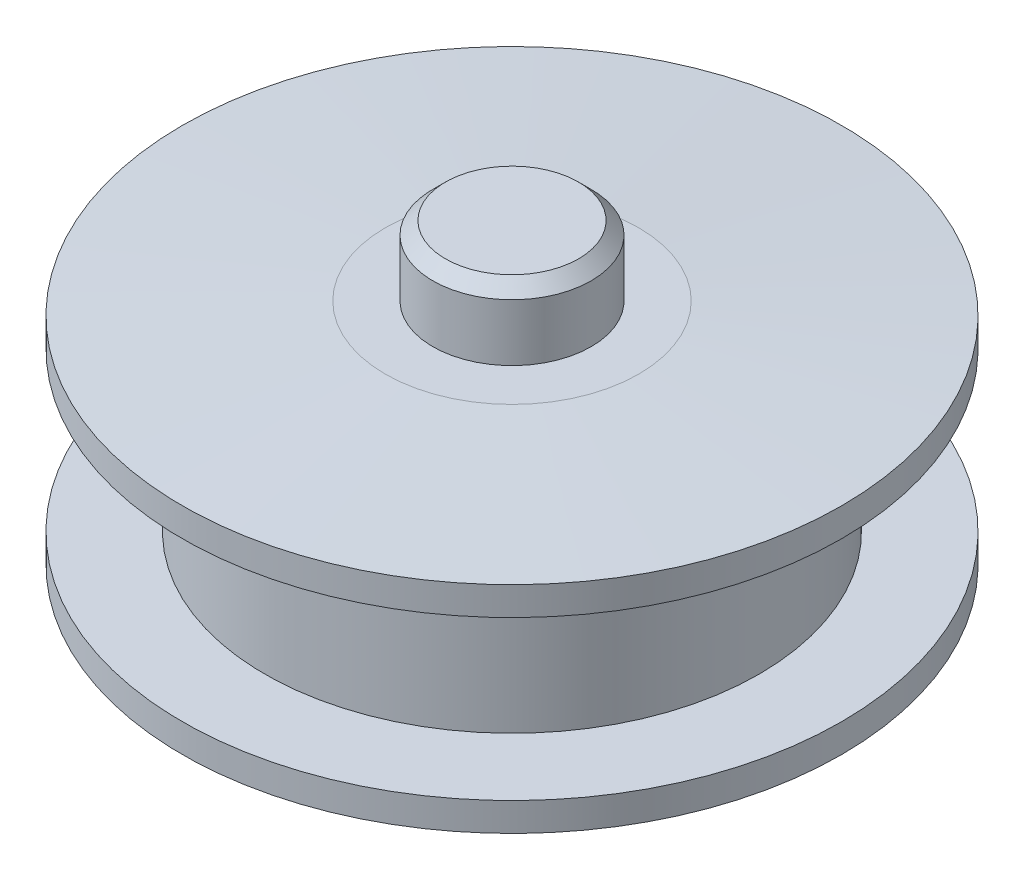
ISO-10303-21;
HEADER;
FILE_DESCRIPTION(('STEP AP214'),'2;1');
FILE_NAME('part.step','',(''),(''),'','','');
FILE_SCHEMA(('AUTOMOTIVE_DESIGN { 1 0 10303 214 1 1 1 1 }'));
ENDSEC;
DATA;
#1=APPLICATION_CONTEXT('core data for automotive mechanical design processes');
#2=APPLICATION_PROTOCOL_DEFINITION('international standard','automotive_design',2000,#1);
#3=PRODUCT_CONTEXT('',#1,'mechanical');
#4=PRODUCT('Part','Part','',(#3));
#5=PRODUCT_RELATED_PRODUCT_CATEGORY('part','',(#4));
#6=PRODUCT_DEFINITION_FORMATION('','',#4);
#7=PRODUCT_DEFINITION_CONTEXT('part definition',#1,'design');
#8=PRODUCT_DEFINITION('design','',#6,#7);
#9=PRODUCT_DEFINITION_SHAPE('','',#8);
#10=(LENGTH_UNIT() NAMED_UNIT(*) SI_UNIT(.MILLI.,.METRE.));
#11=(NAMED_UNIT(*) PLANE_ANGLE_UNIT() SI_UNIT($,.RADIAN.));
#12=(NAMED_UNIT(*) SI_UNIT($,.STERADIAN.) SOLID_ANGLE_UNIT());
#13=UNCERTAINTY_MEASURE_WITH_UNIT(LENGTH_MEASURE(1.E-05),#10,'distance_accuracy_value','');
#14=(GEOMETRIC_REPRESENTATION_CONTEXT(3) GLOBAL_UNCERTAINTY_ASSIGNED_CONTEXT((#13)) GLOBAL_UNIT_ASSIGNED_CONTEXT((#10,
#11,#12)) REPRESENTATION_CONTEXT('',''));
#15=CARTESIAN_POINT('',(0.,0.,0.));
#16=DIRECTION('',(0.,0.,1.));
#17=DIRECTION('',(1.,0.,0.));
#18=AXIS2_PLACEMENT_3D('',#15,#16,#17);
#19=CARTESIAN_POINT('',(0.,2.79999999999991,0.));
#20=DIRECTION('',(0.,-1.,0.));
#21=DIRECTION('',(1.,0.,0.));
#22=AXIS2_PLACEMENT_3D('',#19,#20,#21);
#23=CONICAL_SURFACE('',#22,1.25,0.785398163397448);
#24=CARTESIAN_POINT('',(0.,2.99999999999989,0.));
#25=DIRECTION('',(0.,-1.,0.));
#26=DIRECTION('',(1.,0.,0.));
#27=AXIS2_PLACEMENT_3D('',#24,#25,#26);
#28=CIRCLE('',#27,1.05000000000002);
#29=CARTESIAN_POINT('',(1.05000000000002,2.99999999999989,0.));
#30=VERTEX_POINT('',#29);
#31=EDGE_CURVE('E76',#30,#30,#28,.T.);
#32=ORIENTED_EDGE('',*,*,#31,.T.);
#33=EDGE_LOOP('',(#32));
#34=FACE_BOUND('',#33,.T.);
#35=CARTESIAN_POINT('',(0.,2.79999999999991,0.));
#36=DIRECTION('',(0.,-1.,0.));
#37=DIRECTION('',(1.,0.,0.));
#38=AXIS2_PLACEMENT_3D('',#35,#36,#37);
#39=CIRCLE('',#38,1.25);
#40=CARTESIAN_POINT('',(1.25,2.79999999999991,0.));
#41=VERTEX_POINT('',#40);
#42=EDGE_CURVE('E10',#41,#41,#39,.T.);
#43=ORIENTED_EDGE('',*,*,#42,.F.);
#44=EDGE_LOOP('',(#43));
#45=FACE_BOUND('',#44,.T.);
#46=ADVANCED_FACE('F30',(#34,#45),#23,.T.);
#47=CARTESIAN_POINT('',(0.,2.99999999999989,0.));
#48=DIRECTION('',(0.,-1.,0.));
#49=DIRECTION('',(1.,0.,0.));
#50=AXIS2_PLACEMENT_3D('',#47,#48,#49);
#51=CYLINDRICAL_SURFACE('',#50,1.25);
#52=ORIENTED_EDGE('',*,*,#42,.T.);
#53=EDGE_LOOP('',(#52));
#54=FACE_BOUND('',#53,.T.);
#55=CARTESIAN_POINT('',(0.,1.9,0.));
#56=DIRECTION('',(0.,-1.,0.));
#57=DIRECTION('',(1.,0.,0.));
#58=AXIS2_PLACEMENT_3D('',#55,#56,#57);
#59=CIRCLE('',#58,1.25);
#60=CARTESIAN_POINT('',(1.25,1.9,0.));
#61=VERTEX_POINT('',#60);
#62=EDGE_CURVE('E36',#61,#61,#59,.T.);
#63=ORIENTED_EDGE('',*,*,#62,.F.);
#64=EDGE_LOOP('',(#63));
#65=FACE_BOUND('',#64,.T.);
#66=ADVANCED_FACE('F93',(#54,#65),#51,.T.);
#67=CARTESIAN_POINT('',(2.00000000000036,1.90000000000001,0.));
#68=DIRECTION('',(0.,1.,0.));
#69=DIRECTION('',(-1.,0.,0.));
#70=AXIS2_PLACEMENT_3D('',#67,#68,#69);
#71=PLANE('',#70);
#72=ORIENTED_EDGE('',*,*,#62,.T.);
#73=EDGE_LOOP('',(#72));
#74=FACE_BOUND('',#73,.T.);
#75=CARTESIAN_POINT('',(0.,1.90000000000001,0.));
#76=DIRECTION('',(0.,-1.,0.));
#77=DIRECTION('',(1.,0.,0.));
#78=AXIS2_PLACEMENT_3D('',#75,#76,#77);
#79=CIRCLE('',#78,2.00000000000036);
#80=CARTESIAN_POINT('',(2.00000000000036,1.90000000000001,0.));
#81=VERTEX_POINT('',#80);
#82=EDGE_CURVE('E40',#81,#81,#79,.T.);
#83=ORIENTED_EDGE('',*,*,#82,.F.);
#84=EDGE_LOOP('',(#83));
#85=FACE_BOUND('',#84,.T.);
#86=ADVANCED_FACE('F97',(#74,#85),#71,.T.);
#87=CARTESIAN_POINT('',(0.,1.70000000000003,0.));
#88=DIRECTION('',(0.,-1.,0.));
#89=DIRECTION('',(1.,0.,0.));
#90=AXIS2_PLACEMENT_3D('',#87,#88,#89);
#91=CONICAL_SURFACE('',#90,5.2,1.50837751679894);
#92=ORIENTED_EDGE('',*,*,#82,.T.);
#93=EDGE_LOOP('',(#92));
#94=FACE_BOUND('',#93,.T.);
#95=CARTESIAN_POINT('',(0.,1.70000000000003,0.));
#96=DIRECTION('',(0.,-1.,0.));
#97=DIRECTION('',(1.,0.,0.));
#98=AXIS2_PLACEMENT_3D('',#95,#96,#97);
#99=CIRCLE('',#98,5.2);
#100=CARTESIAN_POINT('',(5.2,1.70000000000003,0.));
#101=VERTEX_POINT('',#100);
#102=EDGE_CURVE('E44',#101,#101,#99,.T.);
#103=ORIENTED_EDGE('',*,*,#102,.F.);
#104=EDGE_LOOP('',(#103));
#105=FACE_BOUND('',#104,.T.);
#106=ADVANCED_FACE('F101',(#94,#105),#91,.T.);
#107=CARTESIAN_POINT('',(0.,2.99999999999989,0.));
#108=DIRECTION('',(0.,-1.,0.));
#109=DIRECTION('',(1.,0.,0.));
#110=AXIS2_PLACEMENT_3D('',#107,#108,#109);
#111=CYLINDRICAL_SURFACE('',#110,5.2);
#112=ORIENTED_EDGE('',*,*,#102,.T.);
#113=EDGE_LOOP('',(#112));
#114=FACE_BOUND('',#113,.T.);
#115=CARTESIAN_POINT('',(0.,1.25,0.));
#116=DIRECTION('',(0.,-1.,0.));
#117=DIRECTION('',(1.,0.,0.));
#118=AXIS2_PLACEMENT_3D('',#115,#116,#117);
#119=CIRCLE('',#118,5.2);
#120=CARTESIAN_POINT('',(5.2,1.25,0.));
#121=VERTEX_POINT('',#120);
#122=EDGE_CURVE('E49',#121,#121,#119,.T.);
#123=ORIENTED_EDGE('',*,*,#122,.F.);
#124=EDGE_LOOP('',(#123));
#125=FACE_BOUND('',#124,.T.);
#126=ADVANCED_FACE('F107',(#114,#125),#111,.T.);
#127=CARTESIAN_POINT('',(3.9,1.25,0.));
#128=DIRECTION('',(0.,-1.,0.));
#129=DIRECTION('',(1.,0.,0.));
#130=AXIS2_PLACEMENT_3D('',#127,#128,#129);
#131=PLANE('',#130);
#132=ORIENTED_EDGE('',*,*,#122,.T.);
#133=EDGE_LOOP('',(#132));
#134=FACE_BOUND('',#133,.T.);
#135=CARTESIAN_POINT('',(0.,1.25,0.));
#136=DIRECTION('',(0.,-1.,0.));
#137=DIRECTION('',(1.,0.,0.));
#138=AXIS2_PLACEMENT_3D('',#135,#136,#137);
#139=CIRCLE('',#138,3.9);
#140=CARTESIAN_POINT('',(3.9,1.25,0.));
#141=VERTEX_POINT('',#140);
#142=EDGE_CURVE('E52',#141,#141,#139,.T.);
#143=ORIENTED_EDGE('',*,*,#142,.F.);
#144=EDGE_LOOP('',(#143));
#145=FACE_BOUND('',#144,.T.);
#146=ADVANCED_FACE('F111',(#134,#145),#131,.T.);
#147=CARTESIAN_POINT('',(0.,2.99999999999989,0.));
#148=DIRECTION('',(0.,-1.,0.));
#149=DIRECTION('',(1.,0.,0.));
#150=AXIS2_PLACEMENT_3D('',#147,#148,#149);
#151=CYLINDRICAL_SURFACE('',#150,3.9);
#152=ORIENTED_EDGE('',*,*,#142,.T.);
#153=EDGE_LOOP('',(#152));
#154=FACE_BOUND('',#153,.T.);
#155=CARTESIAN_POINT('',(0.,-1.25,0.));
#156=DIRECTION('',(0.,-1.,0.));
#157=DIRECTION('',(1.,0.,0.));
#158=AXIS2_PLACEMENT_3D('',#155,#156,#157);
#159=CIRCLE('',#158,3.9);
#160=CARTESIAN_POINT('',(3.9,-1.25,0.));
#161=VERTEX_POINT('',#160);
#162=EDGE_CURVE('E55',#161,#161,#159,.T.);
#163=ORIENTED_EDGE('',*,*,#162,.F.);
#164=EDGE_LOOP('',(#163));
#165=FACE_BOUND('',#164,.T.);
#166=ADVANCED_FACE('F115',(#154,#165),#151,.T.);
#167=CARTESIAN_POINT('',(5.2,-1.25,0.));
#168=DIRECTION('',(0.,1.,0.));
#169=DIRECTION('',(-1.,0.,0.));
#170=AXIS2_PLACEMENT_3D('',#167,#168,#169);
#171=PLANE('',#170);
#172=ORIENTED_EDGE('',*,*,#162,.T.);
#173=EDGE_LOOP('',(#172));
#174=FACE_BOUND('',#173,.T.);
#175=CARTESIAN_POINT('',(0.,-1.25,0.));
#176=DIRECTION('',(0.,-1.,0.));
#177=DIRECTION('',(1.,0.,0.));
#178=AXIS2_PLACEMENT_3D('',#175,#176,#177);
#179=CIRCLE('',#178,5.2);
#180=CARTESIAN_POINT('',(5.2,-1.25,0.));
#181=VERTEX_POINT('',#180);
#182=EDGE_CURVE('E58',#181,#181,#179,.T.);
#183=ORIENTED_EDGE('',*,*,#182,.F.);
#184=EDGE_LOOP('',(#183));
#185=FACE_BOUND('',#184,.T.);
#186=ADVANCED_FACE('F119',(#174,#185),#171,.T.);
#187=CARTESIAN_POINT('',(0.,2.99999999999989,0.));
#188=DIRECTION('',(0.,-1.,0.));
#189=DIRECTION('',(1.,0.,0.));
#190=AXIS2_PLACEMENT_3D('',#187,#188,#189);
#191=CYLINDRICAL_SURFACE('',#190,5.2);
#192=ORIENTED_EDGE('',*,*,#182,.T.);
#193=EDGE_LOOP('',(#192));
#194=FACE_BOUND('',#193,.T.);
#195=CARTESIAN_POINT('',(0.,-1.7,0.));
#196=DIRECTION('',(0.,-1.,0.));
#197=DIRECTION('',(1.,0.,0.));
#198=AXIS2_PLACEMENT_3D('',#195,#196,#197);
#199=CIRCLE('',#198,5.2);
#200=CARTESIAN_POINT('',(5.2,-1.7,0.));
#201=VERTEX_POINT('',#200);
#202=EDGE_CURVE('E61',#201,#201,#199,.T.);
#203=ORIENTED_EDGE('',*,*,#202,.F.);
#204=EDGE_LOOP('',(#203));
#205=FACE_BOUND('',#204,.T.);
#206=ADVANCED_FACE('F123',(#194,#205),#191,.T.);
#207=CARTESIAN_POINT('',(0.,-1.9,0.));
#208=DIRECTION('',(0.,1.,0.));
#209=DIRECTION('',(-1.,0.,0.));
#210=AXIS2_PLACEMENT_3D('',#207,#208,#209);
#211=CONICAL_SURFACE('',#210,2.,1.50837751679894);
#212=ORIENTED_EDGE('',*,*,#202,.T.);
#213=EDGE_LOOP('',(#212));
#214=FACE_BOUND('',#213,.T.);
#215=CARTESIAN_POINT('',(0.,-1.9,0.));
#216=DIRECTION('',(0.,-1.,0.));
#217=DIRECTION('',(1.,0.,0.));
#218=AXIS2_PLACEMENT_3D('',#215,#216,#217);
#219=CIRCLE('',#218,2.);
#220=CARTESIAN_POINT('',(2.,-1.9,0.));
#221=VERTEX_POINT('',#220);
#222=EDGE_CURVE('E64',#221,#221,#219,.T.);
#223=ORIENTED_EDGE('',*,*,#222,.F.);
#224=EDGE_LOOP('',(#223));
#225=FACE_BOUND('',#224,.T.);
#226=ADVANCED_FACE('F127',(#214,#225),#211,.T.);
#227=CARTESIAN_POINT('',(1.25,-1.9,0.));
#228=DIRECTION('',(0.,-1.,0.));
#229=DIRECTION('',(1.,0.,0.));
#230=AXIS2_PLACEMENT_3D('',#227,#228,#229);
#231=PLANE('',#230);
#232=ORIENTED_EDGE('',*,*,#222,.T.);
#233=EDGE_LOOP('',(#232));
#234=FACE_BOUND('',#233,.T.);
#235=CARTESIAN_POINT('',(0.,-1.9,0.));
#236=DIRECTION('',(0.,-1.,0.));
#237=DIRECTION('',(1.,0.,0.));
#238=AXIS2_PLACEMENT_3D('',#235,#236,#237);
#239=CIRCLE('',#238,1.25);
#240=CARTESIAN_POINT('',(1.25,-1.9,0.));
#241=VERTEX_POINT('',#240);
#242=EDGE_CURVE('E67',#241,#241,#239,.T.);
#243=ORIENTED_EDGE('',*,*,#242,.F.);
#244=EDGE_LOOP('',(#243));
#245=FACE_BOUND('',#244,.T.);
#246=ADVANCED_FACE('F131',(#234,#245),#231,.T.);
#247=CARTESIAN_POINT('',(0.,2.99999999999989,0.));
#248=DIRECTION('',(0.,-1.,0.));
#249=DIRECTION('',(1.,0.,0.));
#250=AXIS2_PLACEMENT_3D('',#247,#248,#249);
#251=CYLINDRICAL_SURFACE('',#250,1.25);
#252=ORIENTED_EDGE('',*,*,#242,.T.);
#253=EDGE_LOOP('',(#252));
#254=FACE_BOUND('',#253,.T.);
#255=CARTESIAN_POINT('',(0.,-2.8,0.));
#256=DIRECTION('',(0.,-1.,0.));
#257=DIRECTION('',(1.,0.,0.));
#258=AXIS2_PLACEMENT_3D('',#255,#256,#257);
#259=CIRCLE('',#258,1.25);
#260=CARTESIAN_POINT('',(1.25,-2.8,0.));
#261=VERTEX_POINT('',#260);
#262=EDGE_CURVE('E70',#261,#261,#259,.T.);
#263=ORIENTED_EDGE('',*,*,#262,.F.);
#264=EDGE_LOOP('',(#263));
#265=FACE_BOUND('',#264,.T.);
#266=ADVANCED_FACE('F135',(#254,#265),#251,.T.);
#267=CARTESIAN_POINT('',(0.,-3.,0.));
#268=DIRECTION('',(0.,1.,0.));
#269=DIRECTION('',(-1.,0.,0.));
#270=AXIS2_PLACEMENT_3D('',#267,#268,#269);
#271=CONICAL_SURFACE('',#270,1.05,0.785398163397445);
#272=ORIENTED_EDGE('',*,*,#262,.T.);
#273=EDGE_LOOP('',(#272));
#274=FACE_BOUND('',#273,.T.);
#275=CARTESIAN_POINT('',(0.,-3.,0.));
#276=DIRECTION('',(0.,-1.,0.));
#277=DIRECTION('',(1.,0.,0.));
#278=AXIS2_PLACEMENT_3D('',#275,#276,#277);
#279=CIRCLE('',#278,1.05);
#280=CARTESIAN_POINT('',(1.05,-3.,0.));
#281=VERTEX_POINT('',#280);
#282=EDGE_CURVE('E73',#281,#281,#279,.T.);
#283=ORIENTED_EDGE('',*,*,#282,.F.);
#284=EDGE_LOOP('',(#283));
#285=FACE_BOUND('',#284,.T.);
#286=ADVANCED_FACE('F89',(#274,#285),#271,.T.);
#287=CARTESIAN_POINT('',(0.,-3.,0.));
#288=DIRECTION('',(0.,-1.,0.));
#289=DIRECTION('',(1.,0.,0.));
#290=AXIS2_PLACEMENT_3D('',#287,#288,#289);
#291=PLANE('',#290);
#292=ORIENTED_EDGE('',*,*,#282,.T.);
#293=EDGE_LOOP('',(#292));
#294=FACE_BOUND('',#293,.T.);
#295=ADVANCED_FACE('F84',(#294),#291,.T.);
#296=CARTESIAN_POINT('',(1.05000000000002,2.99999999999989,0.));
#297=DIRECTION('',(0.,1.,0.));
#298=DIRECTION('',(-1.,0.,0.));
#299=AXIS2_PLACEMENT_3D('',#296,#297,#298);
#300=PLANE('',#299);
#301=ORIENTED_EDGE('',*,*,#31,.F.);
#302=EDGE_LOOP('',(#301));
#303=FACE_BOUND('',#302,.T.);
#304=ADVANCED_FACE('F82',(#303),#300,.T.);
#305=CLOSED_SHELL('',(#46,#66,#86,#106,#126,#146,#166,#186,#206,#226,#246,#266,#286,#295,#304));
#306=MANIFOLD_SOLID_BREP('B2',#305);
#307=ADVANCED_BREP_SHAPE_REPRESENTATION('',(#18,#306),#14);
#308=SHAPE_DEFINITION_REPRESENTATION(#9,#307);
ENDSEC;
END-ISO-10303-21;
